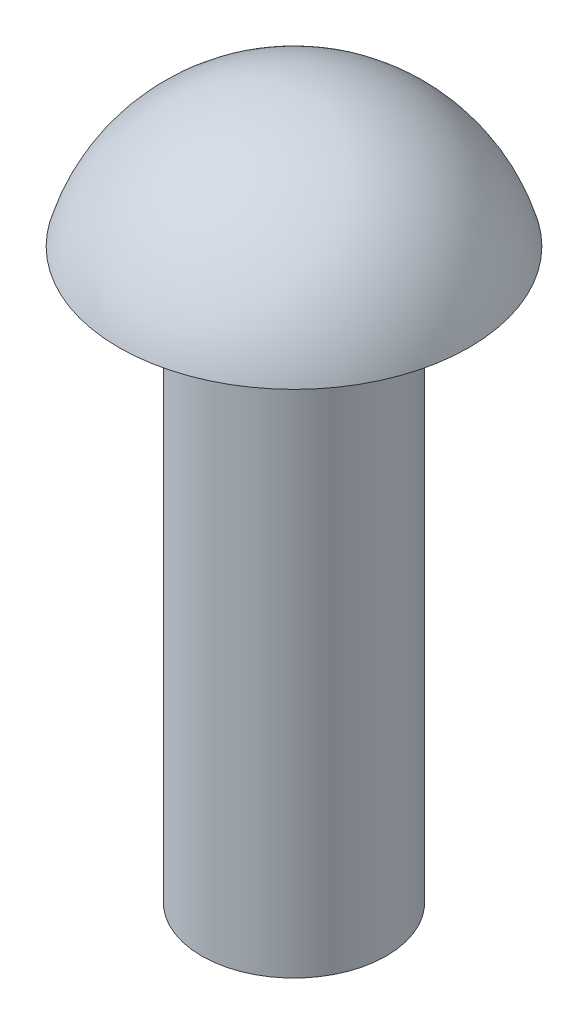
ISO-10303-21;
HEADER;
FILE_DESCRIPTION(('STEP AP214'),'2;1');
FILE_NAME('part.step','',(''),(''),'','','');
FILE_SCHEMA(('AUTOMOTIVE_DESIGN { 1 0 10303 214 1 1 1 1 }'));
ENDSEC;
DATA;
#1=APPLICATION_CONTEXT('core data for automotive mechanical design processes');
#2=APPLICATION_PROTOCOL_DEFINITION('international standard','automotive_design',2000,#1);
#3=PRODUCT_CONTEXT('',#1,'mechanical');
#4=PRODUCT('Part','Part','',(#3));
#5=PRODUCT_RELATED_PRODUCT_CATEGORY('part','',(#4));
#6=PRODUCT_DEFINITION_FORMATION('','',#4);
#7=PRODUCT_DEFINITION_CONTEXT('part definition',#1,'design');
#8=PRODUCT_DEFINITION('design','',#6,#7);
#9=PRODUCT_DEFINITION_SHAPE('','',#8);
#10=(LENGTH_UNIT() NAMED_UNIT(*) SI_UNIT(.MILLI.,.METRE.));
#11=(NAMED_UNIT(*) PLANE_ANGLE_UNIT() SI_UNIT($,.RADIAN.));
#12=(NAMED_UNIT(*) SI_UNIT($,.STERADIAN.) SOLID_ANGLE_UNIT());
#13=UNCERTAINTY_MEASURE_WITH_UNIT(LENGTH_MEASURE(1.E-05),#10,'distance_accuracy_value','');
#14=(GEOMETRIC_REPRESENTATION_CONTEXT(3) GLOBAL_UNCERTAINTY_ASSIGNED_CONTEXT((#13)) GLOBAL_UNIT_ASSIGNED_CONTEXT((#10,
#11,#12)) REPRESENTATION_CONTEXT('',''));
#15=CARTESIAN_POINT('',(0.,0.,0.));
#16=DIRECTION('',(0.,0.,1.));
#17=DIRECTION('',(1.,0.,0.));
#18=AXIS2_PLACEMENT_3D('',#15,#16,#17);
#19=CARTESIAN_POINT('',(0.,-1.92232142857143,0.));
#20=DIRECTION('',(0.,1.,0.));
#21=DIRECTION('',(0.,0.,-1.));
#22=AXIS2_PLACEMENT_3D('',#19,#20,#21);
#23=SPHERICAL_SURFACE('',#22,1.92232142857143);
#24=CARTESIAN_POINT('',(0.,-1.4,0.));
#25=DIRECTION('',(0.,1.,0.));
#26=DIRECTION('',(0.,0.,1.));
#27=AXIS2_PLACEMENT_3D('',#24,#25,#26);
#28=CIRCLE('',#27,1.85);
#29=CARTESIAN_POINT('',(0.,-1.4,1.85));
#30=VERTEX_POINT('',#29);
#31=EDGE_CURVE('E47',#30,#30,#28,.T.);
#32=ORIENTED_EDGE('',*,*,#31,.T.);
#33=EDGE_LOOP('',(#32));
#34=FACE_BOUND('',#33,.T.);
#35=ADVANCED_FACE('F37',(#34),#23,.T.);
#36=CARTESIAN_POINT('',(0.,-7.4,0.));
#37=DIRECTION('',(0.,1.,0.));
#38=DIRECTION('',(0.,0.,1.));
#39=AXIS2_PLACEMENT_3D('',#36,#37,#38);
#40=PLANE('',#39);
#41=CARTESIAN_POINT('',(0.,-7.4,0.));
#42=DIRECTION('',(0.,1.,0.));
#43=DIRECTION('',(0.,0.,1.));
#44=AXIS2_PLACEMENT_3D('',#41,#42,#43);
#45=CIRCLE('',#44,0.975);
#46=CARTESIAN_POINT('',(0.,-7.4,0.974999999999999));
#47=VERTEX_POINT('',#46);
#48=EDGE_CURVE('E10',#47,#47,#45,.T.);
#49=ORIENTED_EDGE('',*,*,#48,.F.);
#50=EDGE_LOOP('',(#49));
#51=FACE_BOUND('',#50,.T.);
#52=ADVANCED_FACE('F62',(#51),#40,.F.);
#53=CARTESIAN_POINT('',(0.,0.,0.));
#54=DIRECTION('',(0.,1.,0.));
#55=DIRECTION('',(0.,0.,1.));
#56=AXIS2_PLACEMENT_3D('',#53,#54,#55);
#57=CYLINDRICAL_SURFACE('',#56,0.975);
#58=CARTESIAN_POINT('',(0.,-1.4,0.));
#59=DIRECTION('',(0.,1.,0.));
#60=DIRECTION('',(0.,0.,1.));
#61=AXIS2_PLACEMENT_3D('',#58,#59,#60);
#62=CIRCLE('',#61,0.975000000000001);
#63=CARTESIAN_POINT('',(0.,-1.4,0.975));
#64=VERTEX_POINT('',#63);
#65=EDGE_CURVE('E43',#64,#64,#62,.T.);
#66=ORIENTED_EDGE('',*,*,#65,.F.);
#67=EDGE_LOOP('',(#66));
#68=FACE_BOUND('',#67,.T.);
#69=ORIENTED_EDGE('',*,*,#48,.T.);
#70=EDGE_LOOP('',(#69));
#71=FACE_BOUND('',#70,.T.);
#72=ADVANCED_FACE('F57',(#68,#71),#57,.T.);
#73=CARTESIAN_POINT('',(0.,-1.4,-0.975000000000001));
#74=DIRECTION('',(0.,1.,0.));
#75=DIRECTION('',(0.,0.,1.));
#76=AXIS2_PLACEMENT_3D('',#73,#74,#75);
#77=PLANE('',#76);
#78=ORIENTED_EDGE('',*,*,#31,.F.);
#79=EDGE_LOOP('',(#78));
#80=FACE_BOUND('',#79,.T.);
#81=ORIENTED_EDGE('',*,*,#65,.T.);
#82=EDGE_LOOP('',(#81));
#83=FACE_BOUND('',#82,.T.);
#84=ADVANCED_FACE('F55',(#80,#83),#77,.F.);
#85=CLOSED_SHELL('',(#35,#52,#72,#84));
#86=MANIFOLD_SOLID_BREP('B2',#85);
#87=ADVANCED_BREP_SHAPE_REPRESENTATION('',(#18,#86),#14);
#88=SHAPE_DEFINITION_REPRESENTATION(#9,#87);
ENDSEC;
END-ISO-10303-21;
